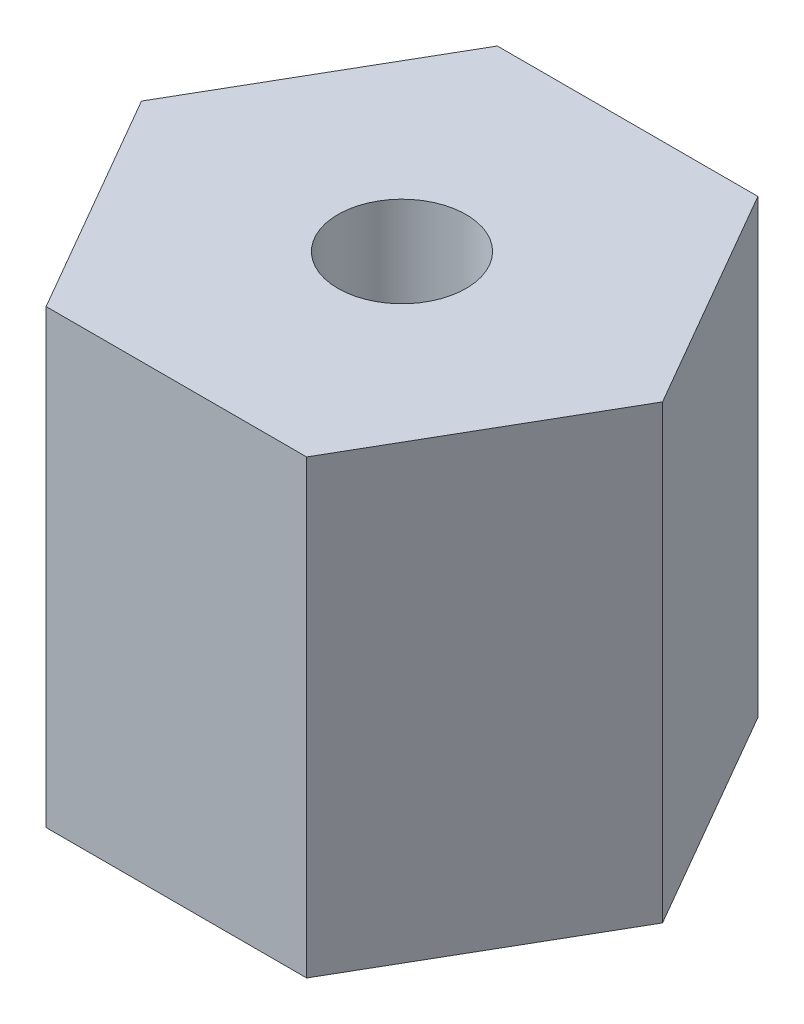
ISO-10303-21;
HEADER;
FILE_DESCRIPTION(('STEP AP214'),'2;1');
FILE_NAME('part.step','',(''),(''),'','','');
FILE_SCHEMA(('AUTOMOTIVE_DESIGN { 1 0 10303 214 1 1 1 1 }'));
ENDSEC;
DATA;
#1=APPLICATION_CONTEXT('core data for automotive mechanical design processes');
#2=APPLICATION_PROTOCOL_DEFINITION('international standard','automotive_design',2000,#1);
#3=PRODUCT_CONTEXT('',#1,'mechanical');
#4=PRODUCT('Part','Part','',(#3));
#5=PRODUCT_RELATED_PRODUCT_CATEGORY('part','',(#4));
#6=PRODUCT_DEFINITION_FORMATION('','',#4);
#7=PRODUCT_DEFINITION_CONTEXT('part definition',#1,'design');
#8=PRODUCT_DEFINITION('design','',#6,#7);
#9=PRODUCT_DEFINITION_SHAPE('','',#8);
#10=(LENGTH_UNIT() NAMED_UNIT(*) SI_UNIT(.MILLI.,.METRE.));
#11=(NAMED_UNIT(*) PLANE_ANGLE_UNIT() SI_UNIT($,.RADIAN.));
#12=(NAMED_UNIT(*) SI_UNIT($,.STERADIAN.) SOLID_ANGLE_UNIT());
#13=UNCERTAINTY_MEASURE_WITH_UNIT(LENGTH_MEASURE(1.E-05),#10,'distance_accuracy_value','');
#14=(GEOMETRIC_REPRESENTATION_CONTEXT(3) GLOBAL_UNCERTAINTY_ASSIGNED_CONTEXT((#13)) GLOBAL_UNIT_ASSIGNED_CONTEXT((#10,
#11,#12)) REPRESENTATION_CONTEXT('',''));
#15=CARTESIAN_POINT('',(0.,0.,0.));
#16=DIRECTION('',(0.,0.,1.));
#17=DIRECTION('',(1.,0.,0.));
#18=AXIS2_PLACEMENT_3D('',#15,#16,#17);
#19=CARTESIAN_POINT('',(2.74963065701559,9.525,4.7625));
#20=DIRECTION('',(-0.866025403784439,0.,-0.5));
#21=DIRECTION('',(-0.5,0.,0.866025403784439));
#22=AXIS2_PLACEMENT_3D('',#19,#20,#21);
#23=PLANE('',#22);
#24=DIRECTION('',(0.5,0.,-0.866025403784439));
#25=VECTOR('',#24,1.);
#26=CARTESIAN_POINT('',(2.74963065701559,0.,4.7625));
#27=LINE('',#26,#25);
#28=CARTESIAN_POINT('',(2.74963065701559,0.,4.7625));
#29=VERTEX_POINT('',#28);
#30=CARTESIAN_POINT('',(5.49926131403119,0.,0.));
#31=VERTEX_POINT('',#30);
#32=EDGE_CURVE('E120',#29,#31,#27,.T.);
#33=ORIENTED_EDGE('',*,*,#32,.T.);
#34=DIRECTION('',(0.,-1.,0.));
#35=VECTOR('',#34,1.);
#36=CARTESIAN_POINT('',(5.49926131403119,9.525,0.));
#37=LINE('',#36,#35);
#38=CARTESIAN_POINT('',(5.49926131403119,9.525,0.));
#39=VERTEX_POINT('',#38);
#40=EDGE_CURVE('E11',#39,#31,#37,.T.);
#41=ORIENTED_EDGE('',*,*,#40,.F.);
#42=DIRECTION('',(0.5,0.,-0.866025403784439));
#43=VECTOR('',#42,1.);
#44=CARTESIAN_POINT('',(2.74963065701559,9.525,4.7625));
#45=LINE('',#44,#43);
#46=CARTESIAN_POINT('',(2.74963065701559,9.525,4.7625));
#47=VERTEX_POINT('',#46);
#48=EDGE_CURVE('E131',#47,#39,#45,.T.);
#49=ORIENTED_EDGE('',*,*,#48,.F.);
#50=DIRECTION('',(0.,-1.,0.));
#51=VECTOR('',#50,1.);
#52=CARTESIAN_POINT('',(2.74963065701559,9.525,4.7625));
#53=LINE('',#52,#51);
#54=EDGE_CURVE('E116',#47,#29,#53,.T.);
#55=ORIENTED_EDGE('',*,*,#54,.T.);
#56=EDGE_LOOP('',(#33,#41,#49,#55));
#57=FACE_BOUND('',#56,.T.);
#58=ADVANCED_FACE('F36',(#57),#23,.F.);
#59=CARTESIAN_POINT('',(5.49926131403119,9.525,0.));
#60=DIRECTION('',(-0.866025403784439,0.,0.5));
#61=DIRECTION('',(0.5,0.,0.866025403784439));
#62=AXIS2_PLACEMENT_3D('',#59,#60,#61);
#63=PLANE('',#62);
#64=DIRECTION('',(-0.5,0.,-0.866025403784439));
#65=VECTOR('',#64,1.);
#66=CARTESIAN_POINT('',(5.49926131403119,0.,0.));
#67=LINE('',#66,#65);
#68=CARTESIAN_POINT('',(2.74963065701559,0.,-4.7625));
#69=VERTEX_POINT('',#68);
#70=EDGE_CURVE('E123',#31,#69,#67,.T.);
#71=ORIENTED_EDGE('',*,*,#70,.T.);
#72=DIRECTION('',(0.,-1.,0.));
#73=VECTOR('',#72,1.);
#74=CARTESIAN_POINT('',(2.74963065701559,9.525,-4.7625));
#75=LINE('',#74,#73);
#76=CARTESIAN_POINT('',(2.74963065701559,9.525,-4.7625));
#77=VERTEX_POINT('',#76);
#78=EDGE_CURVE('E44',#77,#69,#75,.T.);
#79=ORIENTED_EDGE('',*,*,#78,.F.);
#80=DIRECTION('',(-0.5,0.,-0.866025403784439));
#81=VECTOR('',#80,1.);
#82=CARTESIAN_POINT('',(5.49926131403119,9.525,0.));
#83=LINE('',#82,#81);
#84=EDGE_CURVE('E89',#39,#77,#83,.T.);
#85=ORIENTED_EDGE('',*,*,#84,.F.);
#86=ORIENTED_EDGE('',*,*,#40,.T.);
#87=EDGE_LOOP('',(#71,#79,#85,#86));
#88=FACE_BOUND('',#87,.T.);
#89=ADVANCED_FACE('F156',(#88),#63,.F.);
#90=CARTESIAN_POINT('',(2.74963065701559,9.525,-4.7625));
#91=DIRECTION('',(0.,0.,1.));
#92=DIRECTION('',(1.,0.,0.));
#93=AXIS2_PLACEMENT_3D('',#90,#91,#92);
#94=PLANE('',#93);
#95=DIRECTION('',(-1.,0.,0.));
#96=VECTOR('',#95,1.);
#97=CARTESIAN_POINT('',(2.74963065701559,0.,-4.7625));
#98=LINE('',#97,#96);
#99=CARTESIAN_POINT('',(-2.74963065701559,0.,-4.7625));
#100=VERTEX_POINT('',#99);
#101=EDGE_CURVE('E126',#69,#100,#98,.T.);
#102=ORIENTED_EDGE('',*,*,#101,.T.);
#103=DIRECTION('',(0.,-1.,0.));
#104=VECTOR('',#103,1.);
#105=CARTESIAN_POINT('',(-2.74963065701559,9.525,-4.7625));
#106=LINE('',#105,#104);
#107=CARTESIAN_POINT('',(-2.74963065701559,9.525,-4.7625));
#108=VERTEX_POINT('',#107);
#109=EDGE_CURVE('E111',#108,#100,#106,.T.);
#110=ORIENTED_EDGE('',*,*,#109,.F.);
#111=DIRECTION('',(-1.,0.,0.));
#112=VECTOR('',#111,1.);
#113=CARTESIAN_POINT('',(2.74963065701559,9.525,-4.7625));
#114=LINE('',#113,#112);
#115=EDGE_CURVE('E102',#77,#108,#114,.T.);
#116=ORIENTED_EDGE('',*,*,#115,.F.);
#117=ORIENTED_EDGE('',*,*,#78,.T.);
#118=EDGE_LOOP('',(#102,#110,#116,#117));
#119=FACE_BOUND('',#118,.T.);
#120=ADVANCED_FACE('F137',(#119),#94,.F.);
#121=CARTESIAN_POINT('',(-2.74963065701559,9.525,-4.7625));
#122=DIRECTION('',(0.866025403784439,0.,0.5));
#123=DIRECTION('',(0.5,0.,-0.866025403784439));
#124=AXIS2_PLACEMENT_3D('',#121,#122,#123);
#125=PLANE('',#124);
#126=DIRECTION('',(-0.5,0.,0.866025403784439));
#127=VECTOR('',#126,1.);
#128=CARTESIAN_POINT('',(-2.74963065701559,0.,-4.7625));
#129=LINE('',#128,#127);
#130=CARTESIAN_POINT('',(-5.49926131403119,0.,0.));
#131=VERTEX_POINT('',#130);
#132=EDGE_CURVE('E110',#100,#131,#129,.T.);
#133=ORIENTED_EDGE('',*,*,#132,.T.);
#134=DIRECTION('',(0.,-1.,0.));
#135=VECTOR('',#134,1.);
#136=CARTESIAN_POINT('',(-5.49926131403119,9.525,0.));
#137=LINE('',#136,#135);
#138=CARTESIAN_POINT('',(-5.49926131403119,9.525,0.));
#139=VERTEX_POINT('',#138);
#140=EDGE_CURVE('E107',#139,#131,#137,.T.);
#141=ORIENTED_EDGE('',*,*,#140,.F.);
#142=DIRECTION('',(-0.5,0.,0.866025403784439));
#143=VECTOR('',#142,1.);
#144=CARTESIAN_POINT('',(-2.74963065701559,9.525,-4.7625));
#145=LINE('',#144,#143);
#146=EDGE_CURVE('E96',#108,#139,#145,.T.);
#147=ORIENTED_EDGE('',*,*,#146,.F.);
#148=ORIENTED_EDGE('',*,*,#109,.T.);
#149=EDGE_LOOP('',(#133,#141,#147,#148));
#150=FACE_BOUND('',#149,.T.);
#151=ADVANCED_FACE('F108',(#150),#125,.F.);
#152=CARTESIAN_POINT('',(-5.49926131403119,9.525,0.));
#153=DIRECTION('',(0.866025403784439,0.,-0.5));
#154=DIRECTION('',(-0.5,0.,-0.866025403784439));
#155=AXIS2_PLACEMENT_3D('',#152,#153,#154);
#156=PLANE('',#155);
#157=DIRECTION('',(0.5,0.,0.866025403784439));
#158=VECTOR('',#157,1.);
#159=CARTESIAN_POINT('',(-5.49926131403119,0.,0.));
#160=LINE('',#159,#158);
#161=CARTESIAN_POINT('',(-2.7496306570156,0.,4.7625));
#162=VERTEX_POINT('',#161);
#163=EDGE_CURVE('E75',#131,#162,#160,.T.);
#164=ORIENTED_EDGE('',*,*,#163,.T.);
#165=DIRECTION('',(0.,-1.,0.));
#166=VECTOR('',#165,1.);
#167=CARTESIAN_POINT('',(-2.7496306570156,9.525,4.7625));
#168=LINE('',#167,#166);
#169=CARTESIAN_POINT('',(-2.7496306570156,9.525,4.7625));
#170=VERTEX_POINT('',#169);
#171=EDGE_CURVE('E112',#170,#162,#168,.T.);
#172=ORIENTED_EDGE('',*,*,#171,.F.);
#173=DIRECTION('',(0.5,0.,0.866025403784439));
#174=VECTOR('',#173,1.);
#175=CARTESIAN_POINT('',(-5.49926131403119,9.525,0.));
#176=LINE('',#175,#174);
#177=EDGE_CURVE('E100',#139,#170,#176,.T.);
#178=ORIENTED_EDGE('',*,*,#177,.F.);
#179=ORIENTED_EDGE('',*,*,#140,.T.);
#180=EDGE_LOOP('',(#164,#172,#178,#179));
#181=FACE_BOUND('',#180,.T.);
#182=ADVANCED_FACE('F114',(#181),#156,.F.);
#183=CARTESIAN_POINT('',(-2.7496306570156,9.525,4.7625));
#184=DIRECTION('',(0.,0.,-1.));
#185=DIRECTION('',(-1.,0.,0.));
#186=AXIS2_PLACEMENT_3D('',#183,#184,#185);
#187=PLANE('',#186);
#188=DIRECTION('',(1.,0.,0.));
#189=VECTOR('',#188,1.);
#190=CARTESIAN_POINT('',(-2.7496306570156,0.,4.7625));
#191=LINE('',#190,#189);
#192=EDGE_CURVE('E81',#162,#29,#191,.T.);
#193=ORIENTED_EDGE('',*,*,#192,.T.);
#194=ORIENTED_EDGE('',*,*,#54,.F.);
#195=DIRECTION('',(1.,0.,0.));
#196=VECTOR('',#195,1.);
#197=CARTESIAN_POINT('',(-2.7496306570156,9.525,4.7625));
#198=LINE('',#197,#196);
#199=EDGE_CURVE('E52',#170,#47,#198,.T.);
#200=ORIENTED_EDGE('',*,*,#199,.F.);
#201=ORIENTED_EDGE('',*,*,#171,.T.);
#202=EDGE_LOOP('',(#193,#194,#200,#201));
#203=FACE_BOUND('',#202,.T.);
#204=ADVANCED_FACE('F144',(#203),#187,.F.);
#205=CARTESIAN_POINT('',(0.,9.525,0.));
#206=DIRECTION('',(0.,1.,0.));
#207=DIRECTION('',(0.,0.,1.));
#208=AXIS2_PLACEMENT_3D('',#205,#206,#207);
#209=PLANE('',#208);
#210=CARTESIAN_POINT('',(0.,9.525,0.));
#211=DIRECTION('',(0.,1.,0.));
#212=DIRECTION('',(0.,0.,1.));
#213=AXIS2_PLACEMENT_3D('',#210,#211,#212);
#214=CIRCLE('',#213,1.35254999999999);
#215=CARTESIAN_POINT('',(0.,9.525,1.35254999999999));
#216=VERTEX_POINT('',#215);
#217=EDGE_CURVE('E243',#216,#216,#214,.T.);
#218=ORIENTED_EDGE('',*,*,#217,.F.);
#219=EDGE_LOOP('',(#218));
#220=FACE_BOUND('',#219,.T.);
#221=ORIENTED_EDGE('',*,*,#48,.T.);
#222=ORIENTED_EDGE('',*,*,#84,.T.);
#223=ORIENTED_EDGE('',*,*,#115,.T.);
#224=ORIENTED_EDGE('',*,*,#146,.T.);
#225=ORIENTED_EDGE('',*,*,#177,.T.);
#226=ORIENTED_EDGE('',*,*,#199,.T.);
#227=EDGE_LOOP('',(#221,#222,#223,#224,#225,#226));
#228=FACE_BOUND('',#227,.T.);
#229=ADVANCED_FACE('F98',(#220,#228),#209,.T.);
#230=CARTESIAN_POINT('',(0.,0.,0.));
#231=DIRECTION('',(0.,1.,0.));
#232=DIRECTION('',(0.,0.,1.));
#233=AXIS2_PLACEMENT_3D('',#230,#231,#232);
#234=PLANE('',#233);
#235=CARTESIAN_POINT('',(0.,0.,0.));
#236=DIRECTION('',(0.,1.,0.));
#237=DIRECTION('',(0.,0.,1.));
#238=AXIS2_PLACEMENT_3D('',#235,#236,#237);
#239=CIRCLE('',#238,1.35255);
#240=CARTESIAN_POINT('',(0.,0.,1.35255));
#241=VERTEX_POINT('',#240);
#242=EDGE_CURVE('E124',#241,#241,#239,.T.);
#243=ORIENTED_EDGE('',*,*,#242,.T.);
#244=EDGE_LOOP('',(#243));
#245=FACE_BOUND('',#244,.T.);
#246=ORIENTED_EDGE('',*,*,#32,.F.);
#247=ORIENTED_EDGE('',*,*,#192,.F.);
#248=ORIENTED_EDGE('',*,*,#163,.F.);
#249=ORIENTED_EDGE('',*,*,#132,.F.);
#250=ORIENTED_EDGE('',*,*,#101,.F.);
#251=ORIENTED_EDGE('',*,*,#70,.F.);
#252=EDGE_LOOP('',(#246,#247,#248,#249,#250,#251));
#253=FACE_BOUND('',#252,.T.);
#254=ADVANCED_FACE('F140',(#245,#253),#234,.F.);
#255=CARTESIAN_POINT('',(0.,9.525,0.));
#256=DIRECTION('',(0.,1.,0.));
#257=DIRECTION('',(0.,0.,1.));
#258=AXIS2_PLACEMENT_3D('',#255,#256,#257);
#259=CYLINDRICAL_SURFACE('',#258,1.35254999999999);
#260=ORIENTED_EDGE('',*,*,#242,.F.);
#261=EDGE_LOOP('',(#260));
#262=FACE_BOUND('',#261,.T.);
#263=ORIENTED_EDGE('',*,*,#217,.T.);
#264=EDGE_LOOP('',(#263));
#265=FACE_BOUND('',#264,.T.);
#266=ADVANCED_FACE('F196',(#262,#265),#259,.F.);
#267=CLOSED_SHELL('',(#58,#89,#120,#151,#182,#204,#229,#254,#266));
#268=MANIFOLD_SOLID_BREP('B2',#267);
#269=ADVANCED_BREP_SHAPE_REPRESENTATION('',(#18,#268),#14);
#270=SHAPE_DEFINITION_REPRESENTATION(#9,#269);
ENDSEC;
END-ISO-10303-21;
